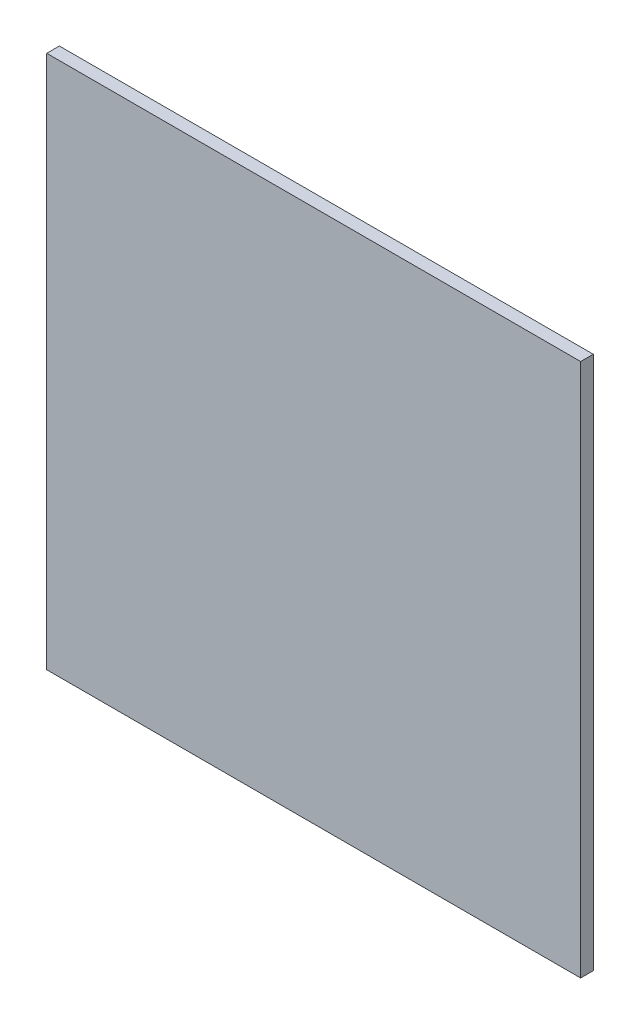
ISO-10303-21;
HEADER;
FILE_DESCRIPTION(('STEP AP214'),'2;1');
FILE_NAME('part.step','',(''),(''),'','','');
FILE_SCHEMA(('AUTOMOTIVE_DESIGN { 1 0 10303 214 1 1 1 1 }'));
ENDSEC;
DATA;
#1=APPLICATION_CONTEXT('core data for automotive mechanical design processes');
#2=APPLICATION_PROTOCOL_DEFINITION('international standard','automotive_design',2000,#1);
#3=PRODUCT_CONTEXT('',#1,'mechanical');
#4=PRODUCT('Part','Part','',(#3));
#5=PRODUCT_RELATED_PRODUCT_CATEGORY('part','',(#4));
#6=PRODUCT_DEFINITION_FORMATION('','',#4);
#7=PRODUCT_DEFINITION_CONTEXT('part definition',#1,'design');
#8=PRODUCT_DEFINITION('design','',#6,#7);
#9=PRODUCT_DEFINITION_SHAPE('','',#8);
#10=(LENGTH_UNIT() NAMED_UNIT(*) SI_UNIT(.MILLI.,.METRE.));
#11=(NAMED_UNIT(*) PLANE_ANGLE_UNIT() SI_UNIT($,.RADIAN.));
#12=(NAMED_UNIT(*) SI_UNIT($,.STERADIAN.) SOLID_ANGLE_UNIT());
#13=UNCERTAINTY_MEASURE_WITH_UNIT(LENGTH_MEASURE(1.E-05),#10,'distance_accuracy_value','');
#14=(GEOMETRIC_REPRESENTATION_CONTEXT(3) GLOBAL_UNCERTAINTY_ASSIGNED_CONTEXT((#13)) GLOBAL_UNIT_ASSIGNED_CONTEXT((#10,
#11,#12)) REPRESENTATION_CONTEXT('',''));
#15=CARTESIAN_POINT('',(0.,0.,0.));
#16=DIRECTION('',(0.,0.,1.));
#17=DIRECTION('',(1.,0.,0.));
#18=AXIS2_PLACEMENT_3D('',#15,#16,#17);
#19=CARTESIAN_POINT('',(4.62508,3.625,0.));
#20=DIRECTION('',(0.,0.,-1.));
#21=DIRECTION('',(-1.,0.,0.));
#22=AXIS2_PLACEMENT_3D('',#19,#20,#21);
#23=PLANE('',#22);
#24=DIRECTION('',(1.,0.,0.));
#25=VECTOR('',#24,1.);
#26=CARTESIAN_POINT('',(3.90008,4.35,0.));
#27=LINE('',#26,#25);
#28=CARTESIAN_POINT('',(3.90008,4.35,0.));
#29=VERTEX_POINT('',#28);
#30=CARTESIAN_POINT('',(5.35008,4.35,0.));
#31=VERTEX_POINT('',#30);
#32=EDGE_CURVE('E55',#29,#31,#27,.T.);
#33=ORIENTED_EDGE('',*,*,#32,.T.);
#34=DIRECTION('',(0.,1.,0.));
#35=VECTOR('',#34,1.);
#36=CARTESIAN_POINT('',(5.35008,4.35,0.));
#37=LINE('',#36,#35);
#38=CARTESIAN_POINT('',(5.35008,2.9,0.));
#39=VERTEX_POINT('',#38);
#40=EDGE_CURVE('E57',#31,#39,#37,.F.);
#41=ORIENTED_EDGE('',*,*,#40,.T.);
#42=DIRECTION('',(1.,0.,0.));
#43=VECTOR('',#42,1.);
#44=CARTESIAN_POINT('',(5.35008,2.9,0.));
#45=LINE('',#44,#43);
#46=CARTESIAN_POINT('',(3.90008,2.9,0.));
#47=VERTEX_POINT('',#46);
#48=EDGE_CURVE('E20',#39,#47,#45,.F.);
#49=ORIENTED_EDGE('',*,*,#48,.T.);
#50=DIRECTION('',(0.,1.,0.));
#51=VECTOR('',#50,1.);
#52=CARTESIAN_POINT('',(3.90008,2.9,0.));
#53=LINE('',#52,#51);
#54=EDGE_CURVE('E80',#47,#29,#53,.T.);
#55=ORIENTED_EDGE('',*,*,#54,.T.);
#56=EDGE_LOOP('',(#33,#41,#49,#55));
#57=FACE_BOUND('',#56,.T.);
#58=ADVANCED_FACE('F17',(#57),#23,.T.);
#59=CARTESIAN_POINT('',(5.35008,2.9,0.));
#60=DIRECTION('',(0.,1.,0.));
#61=DIRECTION('',(0.,0.,1.));
#62=AXIS2_PLACEMENT_3D('',#59,#60,#61);
#63=PLANE('',#62);
#64=DIRECTION('',(0.,0.,-1.));
#65=VECTOR('',#64,1.);
#66=CARTESIAN_POINT('',(3.90008,2.9,0.));
#67=LINE('',#66,#65);
#68=CARTESIAN_POINT('',(3.90008,2.9,0.03429));
#69=VERTEX_POINT('',#68);
#70=EDGE_CURVE('E68',#69,#47,#67,.T.);
#71=ORIENTED_EDGE('',*,*,#70,.T.);
#72=ORIENTED_EDGE('',*,*,#48,.F.);
#73=DIRECTION('',(0.,0.,1.));
#74=VECTOR('',#73,1.);
#75=CARTESIAN_POINT('',(5.35008,2.9,0.));
#76=LINE('',#75,#74);
#77=CARTESIAN_POINT('',(5.35008,2.9,0.03429));
#78=VERTEX_POINT('',#77);
#79=EDGE_CURVE('E63',#39,#78,#76,.T.);
#80=ORIENTED_EDGE('',*,*,#79,.T.);
#81=DIRECTION('',(1.,0.,0.));
#82=VECTOR('',#81,1.);
#83=CARTESIAN_POINT('',(4.62508,2.9,0.03429));
#84=LINE('',#83,#82);
#85=EDGE_CURVE('E83',#69,#78,#84,.T.);
#86=ORIENTED_EDGE('',*,*,#85,.F.);
#87=EDGE_LOOP('',(#71,#72,#80,#86));
#88=FACE_BOUND('',#87,.T.);
#89=ADVANCED_FACE('F65',(#88),#63,.F.);
#90=CARTESIAN_POINT('',(5.35008,4.35,0.));
#91=DIRECTION('',(-1.,0.,0.));
#92=DIRECTION('',(0.,0.,1.));
#93=AXIS2_PLACEMENT_3D('',#90,#91,#92);
#94=PLANE('',#93);
#95=ORIENTED_EDGE('',*,*,#79,.F.);
#96=ORIENTED_EDGE('',*,*,#40,.F.);
#97=DIRECTION('',(0.,0.,-1.));
#98=VECTOR('',#97,1.);
#99=CARTESIAN_POINT('',(5.35008,4.35,0.));
#100=LINE('',#99,#98);
#101=CARTESIAN_POINT('',(5.35008,4.35,0.03429));
#102=VERTEX_POINT('',#101);
#103=EDGE_CURVE('E75',#31,#102,#100,.F.);
#104=ORIENTED_EDGE('',*,*,#103,.T.);
#105=DIRECTION('',(0.,1.,0.));
#106=VECTOR('',#105,1.);
#107=CARTESIAN_POINT('',(5.35008,3.625,0.03429));
#108=LINE('',#107,#106);
#109=EDGE_CURVE('E72',#78,#102,#108,.T.);
#110=ORIENTED_EDGE('',*,*,#109,.F.);
#111=EDGE_LOOP('',(#95,#96,#104,#110));
#112=FACE_BOUND('',#111,.T.);
#113=ADVANCED_FACE('F70',(#112),#94,.F.);
#114=CARTESIAN_POINT('',(3.90008,4.35,0.));
#115=DIRECTION('',(0.,-1.,0.));
#116=DIRECTION('',(0.,0.,-1.));
#117=AXIS2_PLACEMENT_3D('',#114,#115,#116);
#118=PLANE('',#117);
#119=ORIENTED_EDGE('',*,*,#103,.F.);
#120=ORIENTED_EDGE('',*,*,#32,.F.);
#121=DIRECTION('',(0.,0.,-1.));
#122=VECTOR('',#121,1.);
#123=CARTESIAN_POINT('',(3.90008,4.35,0.));
#124=LINE('',#123,#122);
#125=CARTESIAN_POINT('',(3.90008,4.35,0.03429));
#126=VERTEX_POINT('',#125);
#127=EDGE_CURVE('E35',#29,#126,#124,.F.);
#128=ORIENTED_EDGE('',*,*,#127,.T.);
#129=DIRECTION('',(1.,0.,0.));
#130=VECTOR('',#129,1.);
#131=CARTESIAN_POINT('',(4.62508,4.35,0.03429));
#132=LINE('',#131,#130);
#133=EDGE_CURVE('E26',#102,#126,#132,.F.);
#134=ORIENTED_EDGE('',*,*,#133,.F.);
#135=EDGE_LOOP('',(#119,#120,#128,#134));
#136=FACE_BOUND('',#135,.T.);
#137=ADVANCED_FACE('F89',(#136),#118,.F.);
#138=CARTESIAN_POINT('',(3.90008,2.9,0.));
#139=DIRECTION('',(1.,0.,0.));
#140=DIRECTION('',(0.,0.,-1.));
#141=AXIS2_PLACEMENT_3D('',#138,#139,#140);
#142=PLANE('',#141);
#143=ORIENTED_EDGE('',*,*,#127,.F.);
#144=ORIENTED_EDGE('',*,*,#54,.F.);
#145=ORIENTED_EDGE('',*,*,#70,.F.);
#146=DIRECTION('',(0.,1.,0.));
#147=VECTOR('',#146,1.);
#148=CARTESIAN_POINT('',(3.90008,3.625,0.03429));
#149=LINE('',#148,#147);
#150=EDGE_CURVE('E11',#126,#69,#149,.F.);
#151=ORIENTED_EDGE('',*,*,#150,.F.);
#152=EDGE_LOOP('',(#143,#144,#145,#151));
#153=FACE_BOUND('',#152,.T.);
#154=ADVANCED_FACE('F91',(#153),#142,.F.);
#155=CARTESIAN_POINT('',(4.62508,3.625,0.03429));
#156=DIRECTION('',(0.,0.,1.));
#157=DIRECTION('',(1.,0.,0.));
#158=AXIS2_PLACEMENT_3D('',#155,#156,#157);
#159=PLANE('',#158);
#160=ORIENTED_EDGE('',*,*,#133,.T.);
#161=ORIENTED_EDGE('',*,*,#150,.T.);
#162=ORIENTED_EDGE('',*,*,#85,.T.);
#163=ORIENTED_EDGE('',*,*,#109,.T.);
#164=EDGE_LOOP('',(#160,#161,#162,#163));
#165=FACE_BOUND('',#164,.T.);
#166=ADVANCED_FACE('F88',(#165),#159,.T.);
#167=CLOSED_SHELL('',(#58,#89,#113,#137,#154,#166));
#168=MANIFOLD_SOLID_BREP('B1',#167);
#169=ADVANCED_BREP_SHAPE_REPRESENTATION('',(#18,#168),#14);
#170=SHAPE_DEFINITION_REPRESENTATION(#9,#169);
ENDSEC;
END-ISO-10303-21;
